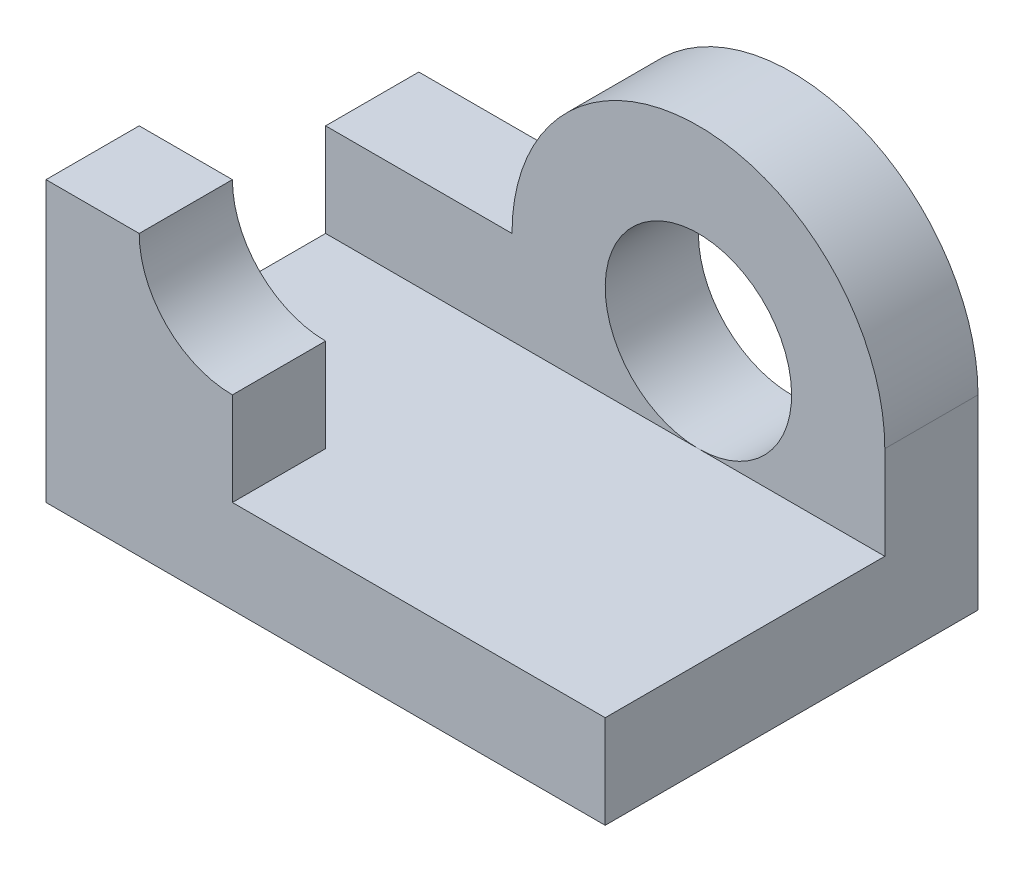
ISO-10303-21;
HEADER;
FILE_DESCRIPTION(('STEP AP214'),'2;1');
FILE_NAME('part.step','',(''),(''),'','','');
FILE_SCHEMA(('AUTOMOTIVE_DESIGN { 1 0 10303 214 1 1 1 1 }'));
ENDSEC;
DATA;
#1=APPLICATION_CONTEXT('core data for automotive mechanical design processes');
#2=APPLICATION_PROTOCOL_DEFINITION('international standard','automotive_design',2000,#1);
#3=PRODUCT_CONTEXT('',#1,'mechanical');
#4=PRODUCT('Part','Part','',(#3));
#5=PRODUCT_RELATED_PRODUCT_CATEGORY('part','',(#4));
#6=PRODUCT_DEFINITION_FORMATION('','',#4);
#7=PRODUCT_DEFINITION_CONTEXT('part definition',#1,'design');
#8=PRODUCT_DEFINITION('design','',#6,#7);
#9=PRODUCT_DEFINITION_SHAPE('','',#8);
#10=(LENGTH_UNIT() NAMED_UNIT(*) SI_UNIT(.MILLI.,.METRE.));
#11=(NAMED_UNIT(*) PLANE_ANGLE_UNIT() SI_UNIT($,.RADIAN.));
#12=(NAMED_UNIT(*) SI_UNIT($,.STERADIAN.) SOLID_ANGLE_UNIT());
#13=UNCERTAINTY_MEASURE_WITH_UNIT(LENGTH_MEASURE(1.E-05),#10,'distance_accuracy_value','');
#14=(GEOMETRIC_REPRESENTATION_CONTEXT(3) GLOBAL_UNCERTAINTY_ASSIGNED_CONTEXT((#13)) GLOBAL_UNIT_ASSIGNED_CONTEXT((#10,
#11,#12)) REPRESENTATION_CONTEXT('',''));
#15=CARTESIAN_POINT('',(0.,0.,0.));
#16=DIRECTION('',(0.,0.,1.));
#17=DIRECTION('',(1.,0.,0.));
#18=AXIS2_PLACEMENT_3D('',#15,#16,#17);
#19=CARTESIAN_POINT('',(2.,0.,1.));
#20=DIRECTION('',(1.,0.,0.));
#21=DIRECTION('',(0.,0.,-1.));
#22=AXIS2_PLACEMENT_3D('',#19,#20,#21);
#23=PLANE('',#22);
#24=DIRECTION('',(0.,-1.,0.));
#25=VECTOR('',#24,1.);
#26=CARTESIAN_POINT('',(2.,0.,1.));
#27=LINE('',#26,#25);
#28=CARTESIAN_POINT('',(2.,2.,1.));
#29=VERTEX_POINT('',#28);
#30=CARTESIAN_POINT('',(2.,0.999999999999998,1.));
#31=VERTEX_POINT('',#30);
#32=EDGE_CURVE('E183',#29,#31,#27,.T.);
#33=ORIENTED_EDGE('',*,*,#32,.T.);
#34=DIRECTION('',(0.,0.,-1.));
#35=VECTOR('',#34,1.);
#36=CARTESIAN_POINT('',(2.,0.999999999999998,4.));
#37=LINE('',#36,#35);
#38=CARTESIAN_POINT('',(2.,0.999999999999998,4.));
#39=VERTEX_POINT('',#38);
#40=EDGE_CURVE('E174',#39,#31,#37,.T.);
#41=ORIENTED_EDGE('',*,*,#40,.F.);
#42=DIRECTION('',(0.,-1.,0.));
#43=VECTOR('',#42,1.);
#44=CARTESIAN_POINT('',(2.,0.,4.));
#45=LINE('',#44,#43);
#46=CARTESIAN_POINT('',(2.,0.,4.));
#47=VERTEX_POINT('',#46);
#48=EDGE_CURVE('E171',#39,#47,#45,.T.);
#49=ORIENTED_EDGE('',*,*,#48,.T.);
#50=DIRECTION('',(0.,0.,-1.));
#51=VECTOR('',#50,1.);
#52=CARTESIAN_POINT('',(2.,0.,1.));
#53=LINE('',#52,#51);
#54=CARTESIAN_POINT('',(2.,0.,0.));
#55=VERTEX_POINT('',#54);
#56=EDGE_CURVE('E195',#47,#55,#53,.T.);
#57=ORIENTED_EDGE('',*,*,#56,.T.);
#58=DIRECTION('',(0.,-1.,0.));
#59=VECTOR('',#58,1.);
#60=CARTESIAN_POINT('',(2.,0.,0.));
#61=LINE('',#60,#59);
#62=CARTESIAN_POINT('',(2.,2.,0.));
#63=VERTEX_POINT('',#62);
#64=EDGE_CURVE('E199',#63,#55,#61,.T.);
#65=ORIENTED_EDGE('',*,*,#64,.F.);
#66=DIRECTION('',(0.,0.,-1.));
#67=VECTOR('',#66,1.);
#68=CARTESIAN_POINT('',(2.,2.,1.));
#69=LINE('',#68,#67);
#70=EDGE_CURVE('E11',#29,#63,#69,.T.);
#71=ORIENTED_EDGE('',*,*,#70,.F.);
#72=EDGE_LOOP('',(#33,#41,#49,#57,#65,#71));
#73=FACE_BOUND('',#72,.T.);
#74=ADVANCED_FACE('F39',(#73),#23,.T.);
#75=CARTESIAN_POINT('',(0.,2.,1.));
#76=DIRECTION('',(0.,0.,-1.));
#77=DIRECTION('',(-1.,0.,0.));
#78=AXIS2_PLACEMENT_3D('',#75,#76,#77);
#79=CYLINDRICAL_SURFACE('',#78,2.);
#80=CARTESIAN_POINT('',(0.,2.,0.));
#81=DIRECTION('',(0.,0.,1.));
#82=DIRECTION('',(1.,0.,0.));
#83=AXIS2_PLACEMENT_3D('',#80,#81,#82);
#84=CIRCLE('',#83,2.);
#85=CARTESIAN_POINT('',(-2.,2.,0.));
#86=VERTEX_POINT('',#85);
#87=EDGE_CURVE('E201',#63,#86,#84,.T.);
#88=ORIENTED_EDGE('',*,*,#87,.T.);
#89=DIRECTION('',(0.,0.,-1.));
#90=VECTOR('',#89,1.);
#91=CARTESIAN_POINT('',(-2.,2.,1.));
#92=LINE('',#91,#90);
#93=CARTESIAN_POINT('',(-2.,2.,1.));
#94=VERTEX_POINT('',#93);
#95=EDGE_CURVE('E47',#94,#86,#92,.T.);
#96=ORIENTED_EDGE('',*,*,#95,.F.);
#97=CARTESIAN_POINT('',(0.,2.,1.));
#98=DIRECTION('',(0.,0.,1.));
#99=DIRECTION('',(1.,0.,0.));
#100=AXIS2_PLACEMENT_3D('',#97,#98,#99);
#101=CIRCLE('',#100,2.);
#102=EDGE_CURVE('E187',#29,#94,#101,.T.);
#103=ORIENTED_EDGE('',*,*,#102,.F.);
#104=ORIENTED_EDGE('',*,*,#70,.T.);
#105=EDGE_LOOP('',(#88,#96,#103,#104));
#106=FACE_BOUND('',#105,.T.);
#107=ADVANCED_FACE('F225',(#106),#79,.T.);
#108=CARTESIAN_POINT('',(0.,2.,1.));
#109=DIRECTION('',(0.,-1.,0.));
#110=DIRECTION('',(1.,0.,0.));
#111=AXIS2_PLACEMENT_3D('',#108,#109,#110);
#112=PLANE('',#111);
#113=DIRECTION('',(-1.,0.,0.));
#114=VECTOR('',#113,1.);
#115=CARTESIAN_POINT('',(0.,2.,0.));
#116=LINE('',#115,#114);
#117=CARTESIAN_POINT('',(-4.,2.,0.));
#118=VERTEX_POINT('',#117);
#119=EDGE_CURVE('E204',#86,#118,#116,.T.);
#120=ORIENTED_EDGE('',*,*,#119,.T.);
#121=DIRECTION('',(0.,0.,-1.));
#122=VECTOR('',#121,1.);
#123=CARTESIAN_POINT('',(-4.,2.,1.));
#124=LINE('',#123,#122);
#125=CARTESIAN_POINT('',(-4.,2.,1.));
#126=VERTEX_POINT('',#125);
#127=EDGE_CURVE('E215',#126,#118,#124,.T.);
#128=ORIENTED_EDGE('',*,*,#127,.F.);
#129=DIRECTION('',(-1.,0.,0.));
#130=VECTOR('',#129,1.);
#131=CARTESIAN_POINT('',(0.,2.,1.));
#132=LINE('',#131,#130);
#133=EDGE_CURVE('E190',#94,#126,#132,.T.);
#134=ORIENTED_EDGE('',*,*,#133,.F.);
#135=ORIENTED_EDGE('',*,*,#95,.T.);
#136=EDGE_LOOP('',(#120,#128,#134,#135));
#137=FACE_BOUND('',#136,.T.);
#138=ADVANCED_FACE('F220',(#137),#112,.F.);
#139=CARTESIAN_POINT('',(-4.,0.,1.));
#140=DIRECTION('',(-1.,0.,0.));
#141=DIRECTION('',(0.,0.,1.));
#142=AXIS2_PLACEMENT_3D('',#139,#140,#141);
#143=PLANE('',#142);
#144=ORIENTED_EDGE('',*,*,#127,.T.);
#145=DIRECTION('',(0.,1.,0.));
#146=VECTOR('',#145,1.);
#147=CARTESIAN_POINT('',(-4.,0.,0.));
#148=LINE('',#147,#146);
#149=CARTESIAN_POINT('',(-4.,0.,0.));
#150=VERTEX_POINT('',#149);
#151=EDGE_CURVE('E207',#150,#118,#148,.T.);
#152=ORIENTED_EDGE('',*,*,#151,.F.);
#153=DIRECTION('',(0.,0.,-1.));
#154=VECTOR('',#153,1.);
#155=CARTESIAN_POINT('',(-4.,0.,1.));
#156=LINE('',#155,#154);
#157=CARTESIAN_POINT('',(-4.,0.,4.));
#158=VERTEX_POINT('',#157);
#159=EDGE_CURVE('E213',#158,#150,#156,.T.);
#160=ORIENTED_EDGE('',*,*,#159,.F.);
#161=DIRECTION('',(0.,1.,0.));
#162=VECTOR('',#161,1.);
#163=CARTESIAN_POINT('',(-4.,0.,4.));
#164=LINE('',#163,#162);
#165=CARTESIAN_POINT('',(-4.,3.,4.));
#166=VERTEX_POINT('',#165);
#167=EDGE_CURVE('E166',#158,#166,#164,.T.);
#168=ORIENTED_EDGE('',*,*,#167,.T.);
#169=DIRECTION('',(0.,0.,-1.));
#170=VECTOR('',#169,1.);
#171=CARTESIAN_POINT('',(-4.,3.,4.));
#172=LINE('',#171,#170);
#173=CARTESIAN_POINT('',(-4.,3.,3.));
#174=VERTEX_POINT('',#173);
#175=EDGE_CURVE('E135',#166,#174,#172,.T.);
#176=ORIENTED_EDGE('',*,*,#175,.T.);
#177=DIRECTION('',(0.,1.,0.));
#178=VECTOR('',#177,1.);
#179=CARTESIAN_POINT('',(-4.,0.,3.));
#180=LINE('',#179,#178);
#181=CARTESIAN_POINT('',(-4.,0.999999999999998,3.));
#182=VERTEX_POINT('',#181);
#183=EDGE_CURVE('E155',#182,#174,#180,.T.);
#184=ORIENTED_EDGE('',*,*,#183,.F.);
#185=DIRECTION('',(0.,0.,-1.));
#186=VECTOR('',#185,1.);
#187=CARTESIAN_POINT('',(-4.,0.999999999999998,4.));
#188=LINE('',#187,#186);
#189=CARTESIAN_POINT('',(-4.,0.999999999999998,1.));
#190=VERTEX_POINT('',#189);
#191=EDGE_CURVE('E59',#182,#190,#188,.T.);
#192=ORIENTED_EDGE('',*,*,#191,.T.);
#193=DIRECTION('',(0.,1.,0.));
#194=VECTOR('',#193,1.);
#195=CARTESIAN_POINT('',(-4.,0.,1.));
#196=LINE('',#195,#194);
#197=EDGE_CURVE('E193',#190,#126,#196,.T.);
#198=ORIENTED_EDGE('',*,*,#197,.T.);
#199=EDGE_LOOP('',(#144,#152,#160,#168,#176,#184,#192,#198));
#200=FACE_BOUND('',#199,.T.);
#201=ADVANCED_FACE('F238',(#200),#143,.T.);
#202=CARTESIAN_POINT('',(0.,2.,1.));
#203=DIRECTION('',(0.,0.,-1.));
#204=DIRECTION('',(-1.,0.,0.));
#205=AXIS2_PLACEMENT_3D('',#202,#203,#204);
#206=CYLINDRICAL_SURFACE('',#205,1.);
#207=CARTESIAN_POINT('',(0.,2.,0.));
#208=DIRECTION('',(0.,0.,1.));
#209=DIRECTION('',(1.,0.,0.));
#210=AXIS2_PLACEMENT_3D('',#207,#208,#209);
#211=CIRCLE('',#210,1.);
#212=CARTESIAN_POINT('',(1.,2.,0.));
#213=VERTEX_POINT('',#212);
#214=EDGE_CURVE('E196',#213,#213,#211,.T.);
#215=ORIENTED_EDGE('',*,*,#214,.F.);
#216=EDGE_LOOP('',(#215));
#217=FACE_BOUND('',#216,.T.);
#218=CARTESIAN_POINT('',(0.,2.,1.));
#219=DIRECTION('',(0.,0.,1.));
#220=DIRECTION('',(1.,0.,0.));
#221=AXIS2_PLACEMENT_3D('',#218,#219,#220);
#222=CIRCLE('',#221,1.);
#223=CARTESIAN_POINT('',(0.,0.999999999999998,1.));
#224=VERTEX_POINT('',#223);
#225=EDGE_CURVE('E180',#224,#224,#222,.T.);
#226=ORIENTED_EDGE('',*,*,#225,.T.);
#227=EDGE_LOOP('',(#226));
#228=FACE_BOUND('',#227,.T.);
#229=ADVANCED_FACE('F41',(#217,#228),#206,.F.);
#230=CARTESIAN_POINT('',(0.,0.,1.));
#231=DIRECTION('',(0.,-1.,0.));
#232=DIRECTION('',(1.,0.,0.));
#233=AXIS2_PLACEMENT_3D('',#230,#231,#232);
#234=PLANE('',#233);
#235=DIRECTION('',(-1.,0.,0.));
#236=VECTOR('',#235,1.);
#237=CARTESIAN_POINT('',(0.,0.,0.));
#238=LINE('',#237,#236);
#239=EDGE_CURVE('E184',#55,#150,#238,.T.);
#240=ORIENTED_EDGE('',*,*,#239,.F.);
#241=ORIENTED_EDGE('',*,*,#56,.F.);
#242=DIRECTION('',(-1.,0.,0.));
#243=VECTOR('',#242,1.);
#244=CARTESIAN_POINT('',(0.,0.,4.));
#245=LINE('',#244,#243);
#246=EDGE_CURVE('E168',#47,#158,#245,.T.);
#247=ORIENTED_EDGE('',*,*,#246,.T.);
#248=ORIENTED_EDGE('',*,*,#159,.T.);
#249=EDGE_LOOP('',(#240,#241,#247,#248));
#250=FACE_BOUND('',#249,.T.);
#251=ADVANCED_FACE('F235',(#250),#234,.T.);
#252=CARTESIAN_POINT('',(0.,0.,1.));
#253=DIRECTION('',(0.,0.,1.));
#254=DIRECTION('',(1.,0.,0.));
#255=AXIS2_PLACEMENT_3D('',#252,#253,#254);
#256=PLANE('',#255);
#257=DIRECTION('',(-1.,0.,0.));
#258=VECTOR('',#257,1.);
#259=CARTESIAN_POINT('',(0.,0.999999999999998,1.));
#260=LINE('',#259,#258);
#261=EDGE_CURVE('E179',#31,#224,#260,.T.);
#262=ORIENTED_EDGE('',*,*,#261,.F.);
#263=ORIENTED_EDGE('',*,*,#32,.F.);
#264=ORIENTED_EDGE('',*,*,#102,.T.);
#265=ORIENTED_EDGE('',*,*,#133,.T.);
#266=ORIENTED_EDGE('',*,*,#197,.F.);
#267=EDGE_CURVE('E177',#224,#190,#260,.T.);
#268=ORIENTED_EDGE('',*,*,#267,.F.);
#269=ORIENTED_EDGE('',*,*,#225,.F.);
#270=EDGE_LOOP('',(#262,#263,#264,#265,#266,#268,#269));
#271=FACE_BOUND('',#270,.T.);
#272=ADVANCED_FACE('F244',(#271),#256,.T.);
#273=CARTESIAN_POINT('',(0.,0.,0.));
#274=DIRECTION('',(0.,0.,1.));
#275=DIRECTION('',(1.,0.,0.));
#276=AXIS2_PLACEMENT_3D('',#273,#274,#275);
#277=PLANE('',#276);
#278=ORIENTED_EDGE('',*,*,#214,.T.);
#279=EDGE_LOOP('',(#278));
#280=FACE_BOUND('',#279,.T.);
#281=ORIENTED_EDGE('',*,*,#64,.T.);
#282=ORIENTED_EDGE('',*,*,#239,.T.);
#283=ORIENTED_EDGE('',*,*,#151,.T.);
#284=ORIENTED_EDGE('',*,*,#119,.F.);
#285=ORIENTED_EDGE('',*,*,#87,.F.);
#286=EDGE_LOOP('',(#281,#282,#283,#284,#285));
#287=FACE_BOUND('',#286,.T.);
#288=ADVANCED_FACE('F228',(#280,#287),#277,.F.);
#289=CARTESIAN_POINT('',(0.,0.999999999999998,4.));
#290=DIRECTION('',(0.,1.,0.));
#291=DIRECTION('',(0.,0.,1.));
#292=AXIS2_PLACEMENT_3D('',#289,#290,#291);
#293=PLANE('',#292);
#294=DIRECTION('',(0.,0.,-1.));
#295=VECTOR('',#294,1.);
#296=CARTESIAN_POINT('',(-2.,0.999999999999998,4.));
#297=LINE('',#296,#295);
#298=CARTESIAN_POINT('',(-2.,0.999999999999998,4.));
#299=VERTEX_POINT('',#298);
#300=CARTESIAN_POINT('',(-2.,0.999999999999998,3.));
#301=VERTEX_POINT('',#300);
#302=EDGE_CURVE('E162',#299,#301,#297,.T.);
#303=ORIENTED_EDGE('',*,*,#302,.F.);
#304=DIRECTION('',(1.,0.,0.));
#305=VECTOR('',#304,1.);
#306=CARTESIAN_POINT('',(0.,0.999999999999998,4.));
#307=LINE('',#306,#305);
#308=EDGE_CURVE('E134',#299,#39,#307,.T.);
#309=ORIENTED_EDGE('',*,*,#308,.T.);
#310=ORIENTED_EDGE('',*,*,#40,.T.);
#311=ORIENTED_EDGE('',*,*,#261,.T.);
#312=ORIENTED_EDGE('',*,*,#267,.T.);
#313=ORIENTED_EDGE('',*,*,#191,.F.);
#314=DIRECTION('',(1.,0.,0.));
#315=VECTOR('',#314,1.);
#316=CARTESIAN_POINT('',(0.,0.999999999999998,3.));
#317=LINE('',#316,#315);
#318=EDGE_CURVE('E54',#182,#301,#317,.T.);
#319=ORIENTED_EDGE('',*,*,#318,.T.);
#320=EDGE_LOOP('',(#303,#309,#310,#311,#312,#313,#319));
#321=FACE_BOUND('',#320,.T.);
#322=ADVANCED_FACE('F252',(#321),#293,.T.);
#323=CARTESIAN_POINT('',(0.,0.,4.));
#324=DIRECTION('',(0.,0.,1.));
#325=DIRECTION('',(1.,0.,0.));
#326=AXIS2_PLACEMENT_3D('',#323,#324,#325);
#327=PLANE('',#326);
#328=ORIENTED_EDGE('',*,*,#308,.F.);
#329=DIRECTION('',(0.,-1.,0.));
#330=VECTOR('',#329,1.);
#331=CARTESIAN_POINT('',(-2.,0.,4.));
#332=LINE('',#331,#330);
#333=CARTESIAN_POINT('',(-2.,2.,4.));
#334=VERTEX_POINT('',#333);
#335=EDGE_CURVE('E143',#334,#299,#332,.T.);
#336=ORIENTED_EDGE('',*,*,#335,.F.);
#337=CARTESIAN_POINT('',(-2.,3.,4.));
#338=DIRECTION('',(0.,0.,1.));
#339=DIRECTION('',(1.,0.,0.));
#340=AXIS2_PLACEMENT_3D('',#337,#338,#339);
#341=CIRCLE('',#340,1.);
#342=CARTESIAN_POINT('',(-3.,3.,4.));
#343=VERTEX_POINT('',#342);
#344=EDGE_CURVE('E126',#343,#334,#341,.T.);
#345=ORIENTED_EDGE('',*,*,#344,.F.);
#346=DIRECTION('',(1.,0.,0.));
#347=VECTOR('',#346,1.);
#348=CARTESIAN_POINT('',(0.,3.,4.));
#349=LINE('',#348,#347);
#350=EDGE_CURVE('E141',#166,#343,#349,.T.);
#351=ORIENTED_EDGE('',*,*,#350,.F.);
#352=ORIENTED_EDGE('',*,*,#167,.F.);
#353=ORIENTED_EDGE('',*,*,#246,.F.);
#354=ORIENTED_EDGE('',*,*,#48,.F.);
#355=EDGE_LOOP('',(#328,#336,#345,#351,#352,#353,#354));
#356=FACE_BOUND('',#355,.T.);
#357=ADVANCED_FACE('F139',(#356),#327,.T.);
#358=CARTESIAN_POINT('',(-2.,3.,4.));
#359=DIRECTION('',(0.,0.,-1.));
#360=DIRECTION('',(-1.,0.,0.));
#361=AXIS2_PLACEMENT_3D('',#358,#359,#360);
#362=CYLINDRICAL_SURFACE('',#361,1.);
#363=CARTESIAN_POINT('',(-2.,3.,3.));
#364=DIRECTION('',(0.,0.,1.));
#365=DIRECTION('',(1.,0.,0.));
#366=AXIS2_PLACEMENT_3D('',#363,#364,#365);
#367=CIRCLE('',#366,1.);
#368=CARTESIAN_POINT('',(-3.,3.,3.));
#369=VERTEX_POINT('',#368);
#370=CARTESIAN_POINT('',(-2.,2.,3.));
#371=VERTEX_POINT('',#370);
#372=EDGE_CURVE('E129',#369,#371,#367,.T.);
#373=ORIENTED_EDGE('',*,*,#372,.F.);
#374=DIRECTION('',(0.,0.,-1.));
#375=VECTOR('',#374,1.);
#376=CARTESIAN_POINT('',(-3.,3.,4.));
#377=LINE('',#376,#375);
#378=EDGE_CURVE('E123',#343,#369,#377,.T.);
#379=ORIENTED_EDGE('',*,*,#378,.F.);
#380=ORIENTED_EDGE('',*,*,#344,.T.);
#381=DIRECTION('',(0.,0.,-1.));
#382=VECTOR('',#381,1.);
#383=CARTESIAN_POINT('',(-2.,2.,4.));
#384=LINE('',#383,#382);
#385=EDGE_CURVE('E149',#334,#371,#384,.T.);
#386=ORIENTED_EDGE('',*,*,#385,.T.);
#387=EDGE_LOOP('',(#373,#379,#380,#386));
#388=FACE_BOUND('',#387,.T.);
#389=ADVANCED_FACE('F125',(#388),#362,.F.);
#390=CARTESIAN_POINT('',(0.,3.,4.));
#391=DIRECTION('',(0.,1.,0.));
#392=DIRECTION('',(0.,0.,1.));
#393=AXIS2_PLACEMENT_3D('',#390,#391,#392);
#394=PLANE('',#393);
#395=DIRECTION('',(1.,0.,0.));
#396=VECTOR('',#395,1.);
#397=CARTESIAN_POINT('',(0.,3.,3.));
#398=LINE('',#397,#396);
#399=EDGE_CURVE('E153',#174,#369,#398,.T.);
#400=ORIENTED_EDGE('',*,*,#399,.F.);
#401=ORIENTED_EDGE('',*,*,#175,.F.);
#402=ORIENTED_EDGE('',*,*,#350,.T.);
#403=ORIENTED_EDGE('',*,*,#378,.T.);
#404=EDGE_LOOP('',(#400,#401,#402,#403));
#405=FACE_BOUND('',#404,.T.);
#406=ADVANCED_FACE('F147',(#405),#394,.T.);
#407=CARTESIAN_POINT('',(-2.,0.,4.));
#408=DIRECTION('',(1.,0.,0.));
#409=DIRECTION('',(0.,0.,-1.));
#410=AXIS2_PLACEMENT_3D('',#407,#408,#409);
#411=PLANE('',#410);
#412=DIRECTION('',(0.,-1.,0.));
#413=VECTOR('',#412,1.);
#414=CARTESIAN_POINT('',(-2.,0.,3.));
#415=LINE('',#414,#413);
#416=EDGE_CURVE('E144',#371,#301,#415,.T.);
#417=ORIENTED_EDGE('',*,*,#416,.F.);
#418=ORIENTED_EDGE('',*,*,#385,.F.);
#419=ORIENTED_EDGE('',*,*,#335,.T.);
#420=ORIENTED_EDGE('',*,*,#302,.T.);
#421=EDGE_LOOP('',(#417,#418,#419,#420));
#422=FACE_BOUND('',#421,.T.);
#423=ADVANCED_FACE('F251',(#422),#411,.T.);
#424=CARTESIAN_POINT('',(0.,0.,3.));
#425=DIRECTION('',(0.,0.,1.));
#426=DIRECTION('',(1.,0.,0.));
#427=AXIS2_PLACEMENT_3D('',#424,#425,#426);
#428=PLANE('',#427);
#429=ORIENTED_EDGE('',*,*,#372,.T.);
#430=ORIENTED_EDGE('',*,*,#416,.T.);
#431=ORIENTED_EDGE('',*,*,#318,.F.);
#432=ORIENTED_EDGE('',*,*,#183,.T.);
#433=ORIENTED_EDGE('',*,*,#399,.T.);
#434=EDGE_LOOP('',(#429,#430,#431,#432,#433));
#435=FACE_BOUND('',#434,.T.);
#436=ADVANCED_FACE('F248',(#435),#428,.F.);
#437=CLOSED_SHELL('',(#74,#107,#138,#201,#229,#251,#272,#288,#322,#357,#389,#406,#423,#436));
#438=MANIFOLD_SOLID_BREP('B2',#437);
#439=ADVANCED_BREP_SHAPE_REPRESENTATION('',(#18,#438),#14);
#440=SHAPE_DEFINITION_REPRESENTATION(#9,#439);
ENDSEC;
END-ISO-10303-21;
